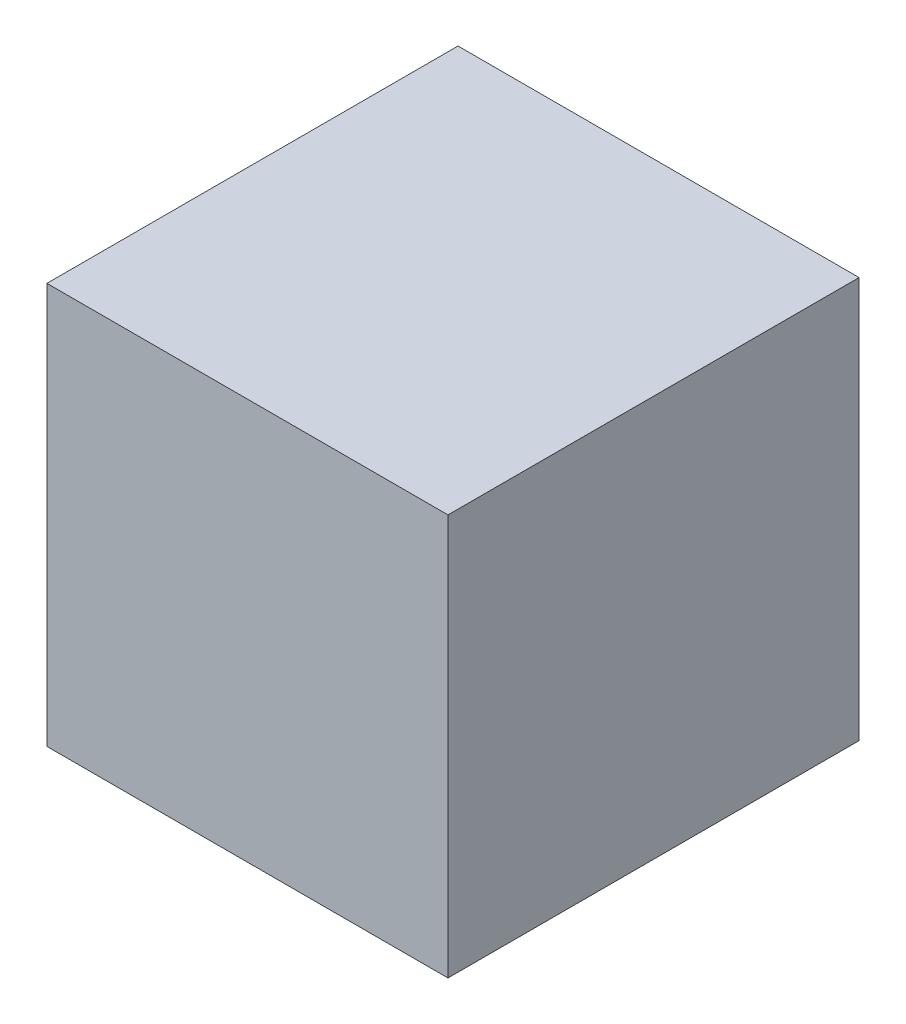
ISO-10303-21;
HEADER;
FILE_DESCRIPTION(('STEP AP214'),'2;1');
FILE_NAME('part.step','',(''),(''),'','','');
FILE_SCHEMA(('AUTOMOTIVE_DESIGN { 1 0 10303 214 1 1 1 1 }'));
ENDSEC;
DATA;
#1=APPLICATION_CONTEXT('core data for automotive mechanical design processes');
#2=APPLICATION_PROTOCOL_DEFINITION('international standard','automotive_design',2000,#1);
#3=PRODUCT_CONTEXT('',#1,'mechanical');
#4=PRODUCT('Part','Part','',(#3));
#5=PRODUCT_RELATED_PRODUCT_CATEGORY('part','',(#4));
#6=PRODUCT_DEFINITION_FORMATION('','',#4);
#7=PRODUCT_DEFINITION_CONTEXT('part definition',#1,'design');
#8=PRODUCT_DEFINITION('design','',#6,#7);
#9=PRODUCT_DEFINITION_SHAPE('','',#8);
#10=(LENGTH_UNIT() NAMED_UNIT(*) SI_UNIT(.MILLI.,.METRE.));
#11=(NAMED_UNIT(*) PLANE_ANGLE_UNIT() SI_UNIT($,.RADIAN.));
#12=(NAMED_UNIT(*) SI_UNIT($,.STERADIAN.) SOLID_ANGLE_UNIT());
#13=UNCERTAINTY_MEASURE_WITH_UNIT(LENGTH_MEASURE(1.E-05),#10,'distance_accuracy_value','');
#14=(GEOMETRIC_REPRESENTATION_CONTEXT(3) GLOBAL_UNCERTAINTY_ASSIGNED_CONTEXT((#13)) GLOBAL_UNIT_ASSIGNED_CONTEXT((#10,
#11,#12)) REPRESENTATION_CONTEXT('',''));
#15=CARTESIAN_POINT('',(0.,0.,0.));
#16=DIRECTION('',(0.,0.,1.));
#17=DIRECTION('',(1.,0.,0.));
#18=AXIS2_PLACEMENT_3D('',#15,#16,#17);
#19=CARTESIAN_POINT('',(0.,0.,0.));
#20=DIRECTION('',(0.,0.,1.));
#21=DIRECTION('',(1.,0.,0.));
#22=AXIS2_PLACEMENT_3D('',#19,#20,#21);
#23=PLANE('',#22);
#24=DIRECTION('',(0.,1.,0.));
#25=VECTOR('',#24,1.);
#26=CARTESIAN_POINT('',(100.,100.,0.));
#27=LINE('',#26,#25);
#28=CARTESIAN_POINT('',(100.,-100.,0.));
#29=VERTEX_POINT('',#28);
#30=CARTESIAN_POINT('',(100.,100.,0.));
#31=VERTEX_POINT('',#30);
#32=EDGE_CURVE('E111',#29,#31,#27,.T.);
#33=ORIENTED_EDGE('',*,*,#32,.F.);
#34=DIRECTION('',(1.,0.,0.));
#35=VECTOR('',#34,1.);
#36=CARTESIAN_POINT('',(-100.,-100.,0.));
#37=LINE('',#36,#35);
#38=CARTESIAN_POINT('',(-100.,-100.,0.));
#39=VERTEX_POINT('',#38);
#40=EDGE_CURVE('E168',#39,#29,#37,.T.);
#41=ORIENTED_EDGE('',*,*,#40,.F.);
#42=DIRECTION('',(0.,-1.,0.));
#43=VECTOR('',#42,1.);
#44=CARTESIAN_POINT('',(-100.,100.,0.));
#45=LINE('',#44,#43);
#46=CARTESIAN_POINT('',(-100.,100.,0.));
#47=VERTEX_POINT('',#46);
#48=EDGE_CURVE('E166',#47,#39,#45,.T.);
#49=ORIENTED_EDGE('',*,*,#48,.F.);
#50=DIRECTION('',(-1.,0.,0.));
#51=VECTOR('',#50,1.);
#52=CARTESIAN_POINT('',(-100.,100.,0.));
#53=LINE('',#52,#51);
#54=EDGE_CURVE('E164',#31,#47,#53,.T.);
#55=ORIENTED_EDGE('',*,*,#54,.F.);
#56=EDGE_LOOP('',(#33,#41,#49,#55));
#57=FACE_BOUND('',#56,.T.);
#58=DIRECTION('',(0.,-1.,0.));
#59=VECTOR('',#58,1.);
#60=CARTESIAN_POINT('',(-95.0000000000001,95.,0.));
#61=LINE('',#60,#59);
#62=CARTESIAN_POINT('',(-95.0000000000001,95.,0.));
#63=VERTEX_POINT('',#62);
#64=CARTESIAN_POINT('',(-95.0000000000001,-95.0000000000002,0.));
#65=VERTEX_POINT('',#64);
#66=EDGE_CURVE('E62',#63,#65,#61,.T.);
#67=ORIENTED_EDGE('',*,*,#66,.T.);
#68=DIRECTION('',(1.,0.,0.));
#69=VECTOR('',#68,1.);
#70=CARTESIAN_POINT('',(95.0000000000001,-95.0000000000002,0.));
#71=LINE('',#70,#69);
#72=CARTESIAN_POINT('',(95.0000000000001,-95.0000000000002,0.));
#73=VERTEX_POINT('',#72);
#74=EDGE_CURVE('E148',#65,#73,#71,.T.);
#75=ORIENTED_EDGE('',*,*,#74,.T.);
#76=DIRECTION('',(0.,1.,0.));
#77=VECTOR('',#76,1.);
#78=CARTESIAN_POINT('',(95.0000000000001,95.,0.));
#79=LINE('',#78,#77);
#80=CARTESIAN_POINT('',(95.0000000000001,95.,0.));
#81=VERTEX_POINT('',#80);
#82=EDGE_CURVE('E151',#73,#81,#79,.T.);
#83=ORIENTED_EDGE('',*,*,#82,.T.);
#84=DIRECTION('',(-1.,0.,0.));
#85=VECTOR('',#84,1.);
#86=CARTESIAN_POINT('',(95.0000000000001,95.,0.));
#87=LINE('',#86,#85);
#88=EDGE_CURVE('E139',#81,#63,#87,.T.);
#89=ORIENTED_EDGE('',*,*,#88,.T.);
#90=EDGE_LOOP('',(#67,#75,#83,#89));
#91=FACE_BOUND('',#90,.T.);
#92=ADVANCED_FACE('F37',(#57,#91),#23,.F.);
#93=CARTESIAN_POINT('',(100.,100.,200.));
#94=DIRECTION('',(-1.,0.,0.));
#95=DIRECTION('',(0.,-1.,0.));
#96=AXIS2_PLACEMENT_3D('',#93,#94,#95);
#97=PLANE('',#96);
#98=ORIENTED_EDGE('',*,*,#32,.T.);
#99=DIRECTION('',(0.,0.,-1.));
#100=VECTOR('',#99,1.);
#101=CARTESIAN_POINT('',(100.,100.,200.));
#102=LINE('',#101,#100);
#103=CARTESIAN_POINT('',(100.,100.,205.));
#104=VERTEX_POINT('',#103);
#105=EDGE_CURVE('E11',#104,#31,#102,.T.);
#106=ORIENTED_EDGE('',*,*,#105,.F.);
#107=DIRECTION('',(0.,1.,0.));
#108=VECTOR('',#107,1.);
#109=CARTESIAN_POINT('',(100.,-100.,205.));
#110=LINE('',#109,#108);
#111=CARTESIAN_POINT('',(100.,-100.,205.));
#112=VERTEX_POINT('',#111);
#113=EDGE_CURVE('E109',#112,#104,#110,.T.);
#114=ORIENTED_EDGE('',*,*,#113,.F.);
#115=DIRECTION('',(0.,0.,-1.));
#116=VECTOR('',#115,1.);
#117=CARTESIAN_POINT('',(100.,-100.,200.));
#118=LINE('',#117,#116);
#119=EDGE_CURVE('E170',#112,#29,#118,.T.);
#120=ORIENTED_EDGE('',*,*,#119,.T.);
#121=EDGE_LOOP('',(#98,#106,#114,#120));
#122=FACE_BOUND('',#121,.T.);
#123=ADVANCED_FACE('F39',(#122),#97,.F.);
#124=CARTESIAN_POINT('',(-100.,100.,200.));
#125=DIRECTION('',(0.,-1.,0.));
#126=DIRECTION('',(0.,0.,-1.));
#127=AXIS2_PLACEMENT_3D('',#124,#125,#126);
#128=PLANE('',#127);
#129=ORIENTED_EDGE('',*,*,#54,.T.);
#130=DIRECTION('',(0.,0.,-1.));
#131=VECTOR('',#130,1.);
#132=CARTESIAN_POINT('',(-100.,100.,200.));
#133=LINE('',#132,#131);
#134=CARTESIAN_POINT('',(-100.,100.,205.));
#135=VERTEX_POINT('',#134);
#136=EDGE_CURVE('E46',#135,#47,#133,.T.);
#137=ORIENTED_EDGE('',*,*,#136,.F.);
#138=DIRECTION('',(-1.,0.,0.));
#139=VECTOR('',#138,1.);
#140=CARTESIAN_POINT('',(-100.,100.,205.));
#141=LINE('',#140,#139);
#142=EDGE_CURVE('E114',#104,#135,#141,.T.);
#143=ORIENTED_EDGE('',*,*,#142,.F.);
#144=ORIENTED_EDGE('',*,*,#105,.T.);
#145=EDGE_LOOP('',(#129,#137,#143,#144));
#146=FACE_BOUND('',#145,.T.);
#147=ADVANCED_FACE('F115',(#146),#128,.F.);
#148=CARTESIAN_POINT('',(-100.,100.,200.));
#149=DIRECTION('',(1.,0.,0.));
#150=DIRECTION('',(0.,1.,0.));
#151=AXIS2_PLACEMENT_3D('',#148,#149,#150);
#152=PLANE('',#151);
#153=ORIENTED_EDGE('',*,*,#48,.T.);
#154=DIRECTION('',(0.,0.,-1.));
#155=VECTOR('',#154,1.);
#156=CARTESIAN_POINT('',(-100.,-100.,200.));
#157=LINE('',#156,#155);
#158=CARTESIAN_POINT('',(-100.,-100.,205.));
#159=VERTEX_POINT('',#158);
#160=EDGE_CURVE('E172',#159,#39,#157,.T.);
#161=ORIENTED_EDGE('',*,*,#160,.F.);
#162=DIRECTION('',(0.,-1.,0.));
#163=VECTOR('',#162,1.);
#164=CARTESIAN_POINT('',(-100.,-100.,205.));
#165=LINE('',#164,#163);
#166=EDGE_CURVE('E120',#135,#159,#165,.T.);
#167=ORIENTED_EDGE('',*,*,#166,.F.);
#168=ORIENTED_EDGE('',*,*,#136,.T.);
#169=EDGE_LOOP('',(#153,#161,#167,#168));
#170=FACE_BOUND('',#169,.T.);
#171=ADVANCED_FACE('F191',(#170),#152,.F.);
#172=CARTESIAN_POINT('',(-100.,-100.,200.));
#173=DIRECTION('',(0.,1.,0.));
#174=DIRECTION('',(0.,0.,1.));
#175=AXIS2_PLACEMENT_3D('',#172,#173,#174);
#176=PLANE('',#175);
#177=CARTESIAN_POINT('',(13.,-100.,5.00000000000002));
#178=DIRECTION('',(0.,-1.,0.));
#179=DIRECTION('',(0.,0.,-1.));
#180=AXIS2_PLACEMENT_3D('',#177,#178,#179);
#181=CIRCLE('',#180,2.5);
#182=CARTESIAN_POINT('',(13.,-100.,2.50000000000003));
#183=VERTEX_POINT('',#182);
#184=EDGE_CURVE('E176',#183,#183,#181,.T.);
#185=ORIENTED_EDGE('',*,*,#184,.F.);
#186=EDGE_LOOP('',(#185));
#187=FACE_BOUND('',#186,.T.);
#188=CARTESIAN_POINT('',(-13.,-100.,5.00000000000002));
#189=DIRECTION('',(0.,-1.,0.));
#190=DIRECTION('',(0.,0.,-1.));
#191=AXIS2_PLACEMENT_3D('',#188,#189,#190);
#192=CIRCLE('',#191,2.5);
#193=CARTESIAN_POINT('',(-13.,-100.,2.50000000000003));
#194=VERTEX_POINT('',#193);
#195=EDGE_CURVE('E130',#194,#194,#192,.T.);
#196=ORIENTED_EDGE('',*,*,#195,.F.);
#197=EDGE_LOOP('',(#196));
#198=FACE_BOUND('',#197,.T.);
#199=ORIENTED_EDGE('',*,*,#40,.T.);
#200=ORIENTED_EDGE('',*,*,#119,.F.);
#201=DIRECTION('',(1.,0.,0.));
#202=VECTOR('',#201,1.);
#203=CARTESIAN_POINT('',(-100.,-100.,205.));
#204=LINE('',#203,#202);
#205=EDGE_CURVE('E125',#159,#112,#204,.T.);
#206=ORIENTED_EDGE('',*,*,#205,.F.);
#207=ORIENTED_EDGE('',*,*,#160,.T.);
#208=EDGE_LOOP('',(#199,#200,#206,#207));
#209=FACE_BOUND('',#208,.T.);
#210=ADVANCED_FACE('F187',(#187,#198,#209),#176,.F.);
#211=CARTESIAN_POINT('',(-95.0000000000001,95.,200.));
#212=DIRECTION('',(1.,0.,0.));
#213=DIRECTION('',(0.,0.,-1.));
#214=AXIS2_PLACEMENT_3D('',#211,#212,#213);
#215=PLANE('',#214);
#216=ORIENTED_EDGE('',*,*,#66,.F.);
#217=DIRECTION('',(0.,0.,-1.));
#218=VECTOR('',#217,1.);
#219=CARTESIAN_POINT('',(-95.0000000000001,95.,200.));
#220=LINE('',#219,#218);
#221=CARTESIAN_POINT('',(-95.0000000000001,95.,200.));
#222=VERTEX_POINT('',#221);
#223=EDGE_CURVE('E146',#222,#63,#220,.T.);
#224=ORIENTED_EDGE('',*,*,#223,.F.);
#225=DIRECTION('',(0.,-1.,0.));
#226=VECTOR('',#225,1.);
#227=CARTESIAN_POINT('',(-95.0000000000001,95.,200.));
#228=LINE('',#227,#226);
#229=CARTESIAN_POINT('',(-95.0000000000001,-95.0000000000002,200.));
#230=VERTEX_POINT('',#229);
#231=EDGE_CURVE('E135',#222,#230,#228,.T.);
#232=ORIENTED_EDGE('',*,*,#231,.T.);
#233=DIRECTION('',(0.,0.,-1.));
#234=VECTOR('',#233,1.);
#235=CARTESIAN_POINT('',(-95.0000000000001,-95.0000000000002,200.));
#236=LINE('',#235,#234);
#237=EDGE_CURVE('E161',#230,#65,#236,.T.);
#238=ORIENTED_EDGE('',*,*,#237,.T.);
#239=EDGE_LOOP('',(#216,#224,#232,#238));
#240=FACE_BOUND('',#239,.T.);
#241=ADVANCED_FACE('F190',(#240),#215,.T.);
#242=CARTESIAN_POINT('',(95.0000000000001,-95.0000000000002,200.));
#243=DIRECTION('',(0.,1.,0.));
#244=DIRECTION('',(0.,0.,1.));
#245=AXIS2_PLACEMENT_3D('',#242,#243,#244);
#246=PLANE('',#245);
#247=CARTESIAN_POINT('',(13.,-95.0000000000002,5.00000000000002));
#248=DIRECTION('',(0.,1.,0.));
#249=DIRECTION('',(0.,0.,1.));
#250=AXIS2_PLACEMENT_3D('',#247,#248,#249);
#251=CIRCLE('',#250,2.5);
#252=CARTESIAN_POINT('',(13.,-95.0000000000002,7.50000000000002));
#253=VERTEX_POINT('',#252);
#254=EDGE_CURVE('E41',#253,#253,#251,.T.);
#255=ORIENTED_EDGE('',*,*,#254,.F.);
#256=EDGE_LOOP('',(#255));
#257=FACE_BOUND('',#256,.T.);
#258=CARTESIAN_POINT('',(-13.,-95.0000000000002,5.00000000000002));
#259=DIRECTION('',(0.,1.,0.));
#260=DIRECTION('',(0.,0.,1.));
#261=AXIS2_PLACEMENT_3D('',#258,#259,#260);
#262=CIRCLE('',#261,2.5);
#263=CARTESIAN_POINT('',(-13.,-95.0000000000002,7.50000000000002));
#264=VERTEX_POINT('',#263);
#265=EDGE_CURVE('E128',#264,#264,#262,.T.);
#266=ORIENTED_EDGE('',*,*,#265,.F.);
#267=EDGE_LOOP('',(#266));
#268=FACE_BOUND('',#267,.T.);
#269=ORIENTED_EDGE('',*,*,#74,.F.);
#270=ORIENTED_EDGE('',*,*,#237,.F.);
#271=DIRECTION('',(1.,0.,0.));
#272=VECTOR('',#271,1.);
#273=CARTESIAN_POINT('',(95.0000000000001,-95.0000000000002,200.));
#274=LINE('',#273,#272);
#275=CARTESIAN_POINT('',(95.0000000000001,-95.0000000000002,200.));
#276=VERTEX_POINT('',#275);
#277=EDGE_CURVE('E138',#230,#276,#274,.T.);
#278=ORIENTED_EDGE('',*,*,#277,.T.);
#279=DIRECTION('',(0.,0.,-1.));
#280=VECTOR('',#279,1.);
#281=CARTESIAN_POINT('',(95.0000000000001,-95.0000000000002,200.));
#282=LINE('',#281,#280);
#283=EDGE_CURVE('E159',#276,#73,#282,.T.);
#284=ORIENTED_EDGE('',*,*,#283,.T.);
#285=EDGE_LOOP('',(#269,#270,#278,#284));
#286=FACE_BOUND('',#285,.T.);
#287=ADVANCED_FACE('F213',(#257,#268,#286),#246,.T.);
#288=CARTESIAN_POINT('',(95.0000000000001,95.,200.));
#289=DIRECTION('',(-1.,0.,0.));
#290=DIRECTION('',(0.,-1.,0.));
#291=AXIS2_PLACEMENT_3D('',#288,#289,#290);
#292=PLANE('',#291);
#293=ORIENTED_EDGE('',*,*,#82,.F.);
#294=ORIENTED_EDGE('',*,*,#283,.F.);
#295=DIRECTION('',(0.,1.,0.));
#296=VECTOR('',#295,1.);
#297=CARTESIAN_POINT('',(95.0000000000001,95.,200.));
#298=LINE('',#297,#296);
#299=CARTESIAN_POINT('',(95.0000000000001,95.,200.));
#300=VERTEX_POINT('',#299);
#301=EDGE_CURVE('E142',#276,#300,#298,.T.);
#302=ORIENTED_EDGE('',*,*,#301,.T.);
#303=DIRECTION('',(0.,0.,-1.));
#304=VECTOR('',#303,1.);
#305=CARTESIAN_POINT('',(95.0000000000001,95.,200.));
#306=LINE('',#305,#304);
#307=EDGE_CURVE('E157',#300,#81,#306,.T.);
#308=ORIENTED_EDGE('',*,*,#307,.T.);
#309=EDGE_LOOP('',(#293,#294,#302,#308));
#310=FACE_BOUND('',#309,.T.);
#311=ADVANCED_FACE('F216',(#310),#292,.T.);
#312=CARTESIAN_POINT('',(95.0000000000001,95.,200.));
#313=DIRECTION('',(0.,-1.,0.));
#314=DIRECTION('',(0.,0.,-1.));
#315=AXIS2_PLACEMENT_3D('',#312,#313,#314);
#316=PLANE('',#315);
#317=ORIENTED_EDGE('',*,*,#88,.F.);
#318=ORIENTED_EDGE('',*,*,#307,.F.);
#319=DIRECTION('',(-1.,0.,0.));
#320=VECTOR('',#319,1.);
#321=CARTESIAN_POINT('',(95.0000000000001,95.,200.));
#322=LINE('',#321,#320);
#323=EDGE_CURVE('E54',#300,#222,#322,.T.);
#324=ORIENTED_EDGE('',*,*,#323,.T.);
#325=ORIENTED_EDGE('',*,*,#223,.T.);
#326=EDGE_LOOP('',(#317,#318,#324,#325));
#327=FACE_BOUND('',#326,.T.);
#328=ADVANCED_FACE('F220',(#327),#316,.T.);
#329=CARTESIAN_POINT('',(0.,0.,200.));
#330=DIRECTION('',(0.,0.,-1.));
#331=DIRECTION('',(-1.,0.,0.));
#332=AXIS2_PLACEMENT_3D('',#329,#330,#331);
#333=PLANE('',#332);
#334=ORIENTED_EDGE('',*,*,#277,.F.);
#335=ORIENTED_EDGE('',*,*,#231,.F.);
#336=ORIENTED_EDGE('',*,*,#323,.F.);
#337=ORIENTED_EDGE('',*,*,#301,.F.);
#338=EDGE_LOOP('',(#334,#335,#336,#337));
#339=FACE_BOUND('',#338,.T.);
#340=ADVANCED_FACE('F224',(#339),#333,.T.);
#341=CARTESIAN_POINT('',(0.,0.,205.));
#342=DIRECTION('',(0.,0.,-1.));
#343=DIRECTION('',(-1.,0.,0.));
#344=AXIS2_PLACEMENT_3D('',#341,#342,#343);
#345=PLANE('',#344);
#346=ORIENTED_EDGE('',*,*,#113,.T.);
#347=ORIENTED_EDGE('',*,*,#142,.T.);
#348=ORIENTED_EDGE('',*,*,#166,.T.);
#349=ORIENTED_EDGE('',*,*,#205,.T.);
#350=EDGE_LOOP('',(#346,#347,#348,#349));
#351=FACE_BOUND('',#350,.T.);
#352=ADVANCED_FACE('F123',(#351),#345,.F.);
#353=CARTESIAN_POINT('',(-13.,-94.0000000000001,5.00000000000002));
#354=DIRECTION('',(0.,-1.,0.));
#355=DIRECTION('',(0.,0.,-1.));
#356=AXIS2_PLACEMENT_3D('',#353,#354,#355);
#357=CYLINDRICAL_SURFACE('',#356,2.5);
#358=ORIENTED_EDGE('',*,*,#265,.T.);
#359=EDGE_LOOP('',(#358));
#360=FACE_BOUND('',#359,.T.);
#361=ORIENTED_EDGE('',*,*,#195,.T.);
#362=EDGE_LOOP('',(#361));
#363=FACE_BOUND('',#362,.T.);
#364=ADVANCED_FACE('F185',(#360,#363),#357,.F.);
#365=CARTESIAN_POINT('',(13.,-94.0000000000001,5.00000000000002));
#366=DIRECTION('',(0.,-1.,0.));
#367=DIRECTION('',(0.,0.,-1.));
#368=AXIS2_PLACEMENT_3D('',#365,#366,#367);
#369=CYLINDRICAL_SURFACE('',#368,2.5);
#370=ORIENTED_EDGE('',*,*,#254,.T.);
#371=EDGE_LOOP('',(#370));
#372=FACE_BOUND('',#371,.T.);
#373=ORIENTED_EDGE('',*,*,#184,.T.);
#374=EDGE_LOOP('',(#373));
#375=FACE_BOUND('',#374,.T.);
#376=ADVANCED_FACE('F232',(#372,#375),#369,.F.);
#377=CLOSED_SHELL('',(#92,#123,#147,#171,#210,#241,#287,#311,#328,#340,#352,#364,#376));
#378=MANIFOLD_SOLID_BREP('B2',#377);
#379=ADVANCED_BREP_SHAPE_REPRESENTATION('',(#18,#378),#14);
#380=SHAPE_DEFINITION_REPRESENTATION(#9,#379);
ENDSEC;
END-ISO-10303-21;
